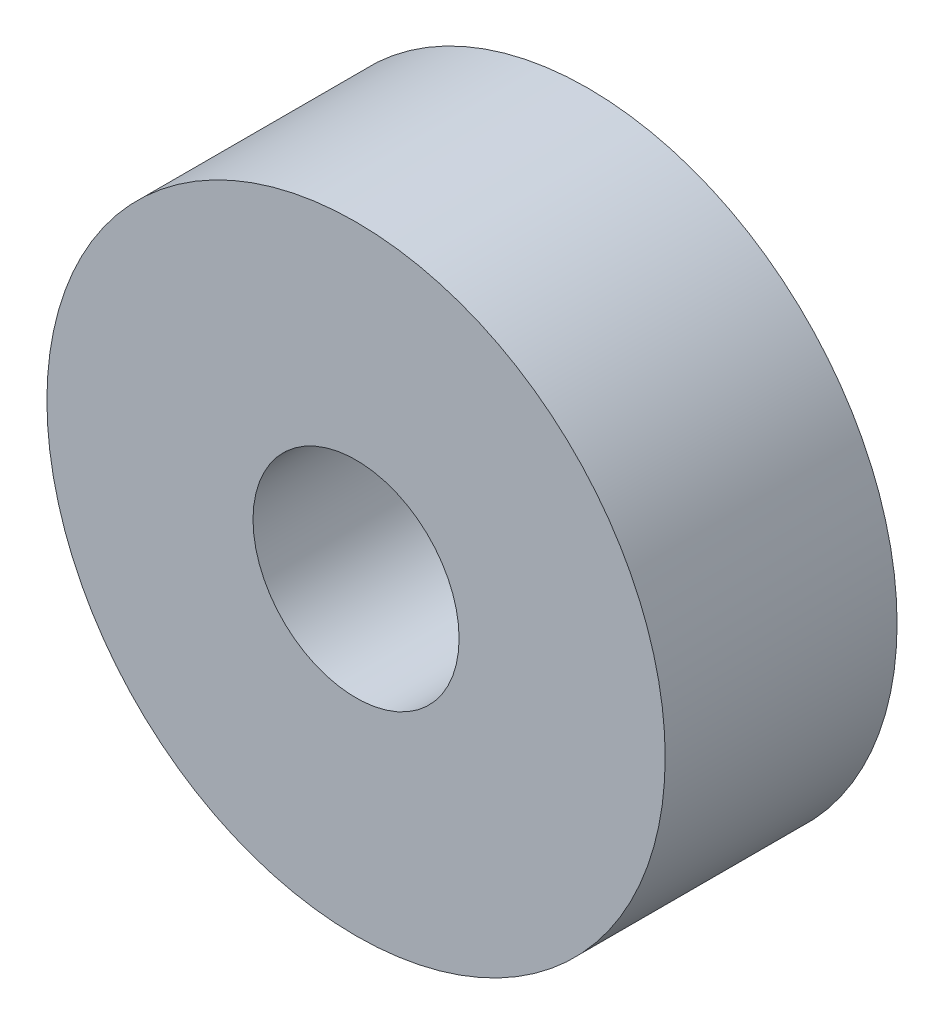
ISO-10303-21;
HEADER;
FILE_DESCRIPTION(('STEP AP214'),'2;1');
FILE_NAME('part.step','',(''),(''),'','','');
FILE_SCHEMA(('AUTOMOTIVE_DESIGN { 1 0 10303 214 1 1 1 1 }'));
ENDSEC;
DATA;
#1=APPLICATION_CONTEXT('core data for automotive mechanical design processes');
#2=APPLICATION_PROTOCOL_DEFINITION('international standard','automotive_design',2000,#1);
#3=PRODUCT_CONTEXT('',#1,'mechanical');
#4=PRODUCT('Part','Part','',(#3));
#5=PRODUCT_RELATED_PRODUCT_CATEGORY('part','',(#4));
#6=PRODUCT_DEFINITION_FORMATION('','',#4);
#7=PRODUCT_DEFINITION_CONTEXT('part definition',#1,'design');
#8=PRODUCT_DEFINITION('design','',#6,#7);
#9=PRODUCT_DEFINITION_SHAPE('','',#8);
#10=(LENGTH_UNIT() NAMED_UNIT(*) SI_UNIT(.MILLI.,.METRE.));
#11=(NAMED_UNIT(*) PLANE_ANGLE_UNIT() SI_UNIT($,.RADIAN.));
#12=(NAMED_UNIT(*) SI_UNIT($,.STERADIAN.) SOLID_ANGLE_UNIT());
#13=UNCERTAINTY_MEASURE_WITH_UNIT(LENGTH_MEASURE(1.E-05),#10,'distance_accuracy_value','');
#14=(GEOMETRIC_REPRESENTATION_CONTEXT(3) GLOBAL_UNCERTAINTY_ASSIGNED_CONTEXT((#13)) GLOBAL_UNIT_ASSIGNED_CONTEXT((#10,
#11,#12)) REPRESENTATION_CONTEXT('',''));
#15=CARTESIAN_POINT('',(0.,0.,0.));
#16=DIRECTION('',(0.,0.,1.));
#17=DIRECTION('',(1.,0.,0.));
#18=AXIS2_PLACEMENT_3D('',#15,#16,#17);
#19=CARTESIAN_POINT('',(0.,0.,7.14502));
#20=DIRECTION('',(0.,0.,1.));
#21=DIRECTION('',(1.,0.,0.));
#22=AXIS2_PLACEMENT_3D('',#19,#20,#21);
#23=PLANE('',#22);
#24=CARTESIAN_POINT('',(0.,0.,7.14502));
#25=DIRECTION('',(0.,0.,1.));
#26=DIRECTION('',(1.,0.,0.));
#27=AXIS2_PLACEMENT_3D('',#24,#25,#26);
#28=CIRCLE('',#27,9.525);
#29=CARTESIAN_POINT('',(9.525,0.,7.14502));
#30=VERTEX_POINT('',#29);
#31=EDGE_CURVE('E10',#30,#30,#28,.T.);
#32=ORIENTED_EDGE('',*,*,#31,.T.);
#33=EDGE_LOOP('',(#32));
#34=FACE_BOUND('',#33,.T.);
#35=CARTESIAN_POINT('',(0.,0.,7.14502));
#36=DIRECTION('',(0.,0.,1.));
#37=DIRECTION('',(1.,0.,0.));
#38=AXIS2_PLACEMENT_3D('',#35,#36,#37);
#39=CIRCLE('',#38,3.175);
#40=CARTESIAN_POINT('',(3.175,0.,7.14502));
#41=VERTEX_POINT('',#40);
#42=EDGE_CURVE('E42',#41,#41,#39,.T.);
#43=ORIENTED_EDGE('',*,*,#42,.F.);
#44=EDGE_LOOP('',(#43));
#45=FACE_BOUND('',#44,.T.);
#46=ADVANCED_FACE('F31',(#34,#45),#23,.T.);
#47=CARTESIAN_POINT('',(0.,0.,0.));
#48=DIRECTION('',(0.,0.,1.));
#49=DIRECTION('',(1.,0.,0.));
#50=AXIS2_PLACEMENT_3D('',#47,#48,#49);
#51=PLANE('',#50);
#52=CARTESIAN_POINT('',(0.,0.,0.));
#53=DIRECTION('',(0.,0.,1.));
#54=DIRECTION('',(1.,0.,0.));
#55=AXIS2_PLACEMENT_3D('',#52,#53,#54);
#56=CIRCLE('',#55,9.525);
#57=CARTESIAN_POINT('',(9.525,0.,0.));
#58=VERTEX_POINT('',#57);
#59=EDGE_CURVE('E35',#58,#58,#56,.T.);
#60=ORIENTED_EDGE('',*,*,#59,.F.);
#61=EDGE_LOOP('',(#60));
#62=FACE_BOUND('',#61,.T.);
#63=CARTESIAN_POINT('',(0.,0.,0.));
#64=DIRECTION('',(0.,0.,1.));
#65=DIRECTION('',(1.,0.,0.));
#66=AXIS2_PLACEMENT_3D('',#63,#64,#65);
#67=CIRCLE('',#66,3.175);
#68=CARTESIAN_POINT('',(3.175,0.,0.));
#69=VERTEX_POINT('',#68);
#70=EDGE_CURVE('E44',#69,#69,#67,.T.);
#71=ORIENTED_EDGE('',*,*,#70,.T.);
#72=EDGE_LOOP('',(#71));
#73=FACE_BOUND('',#72,.T.);
#74=ADVANCED_FACE('F54',(#62,#73),#51,.F.);
#75=CARTESIAN_POINT('',(0.,0.,7.14502));
#76=DIRECTION('',(0.,0.,-1.));
#77=DIRECTION('',(-1.,0.,0.));
#78=AXIS2_PLACEMENT_3D('',#75,#76,#77);
#79=CYLINDRICAL_SURFACE('',#78,9.525);
#80=ORIENTED_EDGE('',*,*,#31,.F.);
#81=EDGE_LOOP('',(#80));
#82=FACE_BOUND('',#81,.T.);
#83=ORIENTED_EDGE('',*,*,#59,.T.);
#84=EDGE_LOOP('',(#83));
#85=FACE_BOUND('',#84,.T.);
#86=ADVANCED_FACE('F33',(#82,#85),#79,.T.);
#87=CARTESIAN_POINT('',(0.,0.,7.14502));
#88=DIRECTION('',(0.,0.,-1.));
#89=DIRECTION('',(-1.,0.,0.));
#90=AXIS2_PLACEMENT_3D('',#87,#88,#89);
#91=CYLINDRICAL_SURFACE('',#90,3.175);
#92=ORIENTED_EDGE('',*,*,#42,.T.);
#93=EDGE_LOOP('',(#92));
#94=FACE_BOUND('',#93,.T.);
#95=ORIENTED_EDGE('',*,*,#70,.F.);
#96=EDGE_LOOP('',(#95));
#97=FACE_BOUND('',#96,.T.);
#98=ADVANCED_FACE('F50',(#94,#97),#91,.F.);
#99=CLOSED_SHELL('',(#46,#74,#86,#98));
#100=MANIFOLD_SOLID_BREP('B2',#99);
#101=ADVANCED_BREP_SHAPE_REPRESENTATION('',(#18,#100),#14);
#102=SHAPE_DEFINITION_REPRESENTATION(#9,#101);
ENDSEC;
END-ISO-10303-21;
